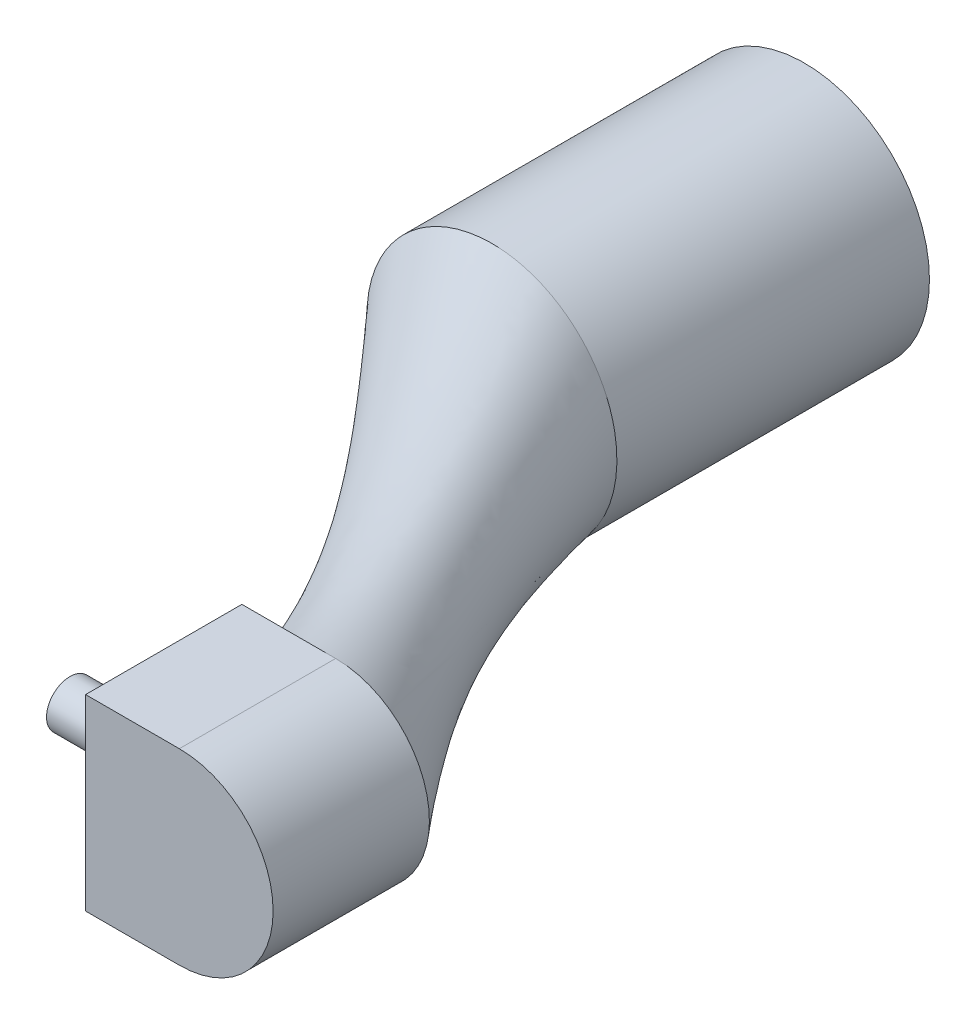
ISO-10303-21;
HEADER;
FILE_DESCRIPTION(('STEP AP214'),'2;1');
FILE_NAME('part.step','',(''),(''),'','','');
FILE_SCHEMA(('AUTOMOTIVE_DESIGN { 1 0 10303 214 1 1 1 1 }'));
ENDSEC;
DATA;
#1=APPLICATION_CONTEXT('core data for automotive mechanical design processes');
#2=APPLICATION_PROTOCOL_DEFINITION('international standard','automotive_design',2000,#1);
#3=PRODUCT_CONTEXT('',#1,'mechanical');
#4=PRODUCT('Part','Part','',(#3));
#5=PRODUCT_RELATED_PRODUCT_CATEGORY('part','',(#4));
#6=PRODUCT_DEFINITION_FORMATION('','',#4);
#7=PRODUCT_DEFINITION_CONTEXT('part definition',#1,'design');
#8=PRODUCT_DEFINITION('design','',#6,#7);
#9=PRODUCT_DEFINITION_SHAPE('','',#8);
#10=(LENGTH_UNIT() NAMED_UNIT(*) SI_UNIT(.MILLI.,.METRE.));
#11=(NAMED_UNIT(*) PLANE_ANGLE_UNIT() SI_UNIT($,.RADIAN.));
#12=(NAMED_UNIT(*) SI_UNIT($,.STERADIAN.) SOLID_ANGLE_UNIT());
#13=UNCERTAINTY_MEASURE_WITH_UNIT(LENGTH_MEASURE(1.E-05),#10,'distance_accuracy_value','');
#14=(GEOMETRIC_REPRESENTATION_CONTEXT(3) GLOBAL_UNCERTAINTY_ASSIGNED_CONTEXT((#13)) GLOBAL_UNIT_ASSIGNED_CONTEXT((#10,
#11,#12)) REPRESENTATION_CONTEXT('',''));
#15=CARTESIAN_POINT('',(0.,0.,0.));
#16=DIRECTION('',(0.,0.,1.));
#17=DIRECTION('',(1.,0.,0.));
#18=AXIS2_PLACEMENT_3D('',#15,#16,#17);
#19=CARTESIAN_POINT('',(8.,0.,28.));
#20=DIRECTION('',(0.,0.,-1.));
#21=DIRECTION('',(-1.,0.,0.));
#22=AXIS2_PLACEMENT_3D('',#19,#20,#21);
#23=CYLINDRICAL_SURFACE('',#22,3.);
#24=CARTESIAN_POINT('',(8.,0.,28.));
#25=DIRECTION('',(0.,0.,1.));
#26=DIRECTION('',(1.,0.,0.));
#27=AXIS2_PLACEMENT_3D('',#24,#25,#26);
#28=CIRCLE('',#27,3.);
#29=CARTESIAN_POINT('',(8.,-3.,28.));
#30=VERTEX_POINT('',#29);
#31=CARTESIAN_POINT('',(8.,3.,28.));
#32=VERTEX_POINT('',#31);
#33=EDGE_CURVE('E72',#30,#32,#28,.T.);
#34=ORIENTED_EDGE('',*,*,#33,.F.);
#35=DIRECTION('',(0.,0.,-1.));
#36=VECTOR('',#35,1.);
#37=CARTESIAN_POINT('',(8.,-3.,28.));
#38=LINE('',#37,#36);
#39=CARTESIAN_POINT('',(7.99691052595879,-2.99999681861154,23.));
#40=VERTEX_POINT('',#39);
#41=EDGE_CURVE('E231',#40,#30,#38,.F.);
#42=ORIENTED_EDGE('',*,*,#41,.F.);
#43=CARTESIAN_POINT('',(8.,0.,23.));
#44=DIRECTION('',(0.,0.,1.));
#45=DIRECTION('',(1.,0.,0.));
#46=AXIS2_PLACEMENT_3D('',#43,#44,#45);
#47=CIRCLE('',#46,3.);
#48=CARTESIAN_POINT('',(8.,3.,23.));
#49=VERTEX_POINT('',#48);
#50=EDGE_CURVE('E57',#40,#49,#47,.T.);
#51=ORIENTED_EDGE('',*,*,#50,.T.);
#52=DIRECTION('',(0.,0.,-1.));
#53=VECTOR('',#52,1.);
#54=CARTESIAN_POINT('',(8.,3.,28.));
#55=LINE('',#54,#53);
#56=EDGE_CURVE('E258',#49,#32,#55,.F.);
#57=ORIENTED_EDGE('',*,*,#56,.T.);
#58=EDGE_LOOP('',(#34,#42,#51,#57));
#59=FACE_BOUND('',#58,.T.);
#60=ADVANCED_FACE('F52',(#59),#23,.T.);
#61=CARTESIAN_POINT('',(0.,0.,10.));
#62=DIRECTION('',(0.,0.,-1.));
#63=DIRECTION('',(-1.,0.,0.));
#64=AXIS2_PLACEMENT_3D('',#61,#62,#63);
#65=CYLINDRICAL_SURFACE('',#64,4.);
#66=CARTESIAN_POINT('',(3.38536776104023,-2.13055981434679,10.));
#67=CARTESIAN_POINT('',(3.5629144122358,-1.8484458342601,10.));
#68=CARTESIAN_POINT('',(3.72945012408968,-1.50772882720066,10.));
#69=CARTESIAN_POINT('',(3.96356947314177,-0.687140070162643,10.));
#70=CARTESIAN_POINT('',(4.03019980479316,-0.204777874511993,10.));
#71=CARTESIAN_POINT('',(3.96484524376381,0.592548144976059,10.));
#72=CARTESIAN_POINT('',(3.91520814162501,0.869797637844003,10.));
#73=CARTESIAN_POINT('',(3.74721493560799,1.42960936951399,10.));
#74=CARTESIAN_POINT('',(3.62866488590891,1.71207909541891,10.));
#75=CARTESIAN_POINT('',(3.3173750321527,2.25686653997276,10.));
#76=CARTESIAN_POINT('',(3.12452087766088,2.51894578965913,10.));
#77=CARTESIAN_POINT('',(2.67212996789271,2.99456842314045,10.));
#78=CARTESIAN_POINT('',(2.41267379443348,3.20782110984467,10.));
#79=CARTESIAN_POINT('',(1.8484458342601,3.5629144122358,10.));
#80=CARTESIAN_POINT('',(1.54394113770462,3.70458693641862,10.));
#81=CARTESIAN_POINT('',(0.919424527747806,3.9067092474301,10.));
#82=CARTESIAN_POINT('',(0.59970956308234,3.96721213488091,10.));
#83=CARTESIAN_POINT('',(-0.0261266069788161,4.01219903339883,10.));
#84=CARTESIAN_POINT('',(-0.33208227767024,3.99688930093181,10.));
#85=CARTESIAN_POINT('',(-0.909475605640934,3.90618187566706,10.));
#86=CARTESIAN_POINT('',(-1.18091375301734,3.83099906278318,10.));
#87=CARTESIAN_POINT('',(-1.92804745463766,3.54500739873836,10.));
#88=CARTESIAN_POINT('',(-2.33411732712935,3.27626933380621,10.));
#89=CARTESIAN_POINT('',(-2.97267527803371,2.71021145592215,10.));
#90=CARTESIAN_POINT('',(-3.20782110984467,2.41267379443348,10.));
#91=CARTESIAN_POINT('',(-3.5629144122358,1.8484458342601,10.));
#92=CARTESIAN_POINT('',(-3.72945012408969,1.50772882720066,10.));
#93=CARTESIAN_POINT('',(-3.96356947314177,0.687140070162641,10.));
#94=CARTESIAN_POINT('',(-4.03019980479316,0.20477787451199,9.99999999999999));
#95=CARTESIAN_POINT('',(-3.96484524376381,-0.59254814497606,10.));
#96=CARTESIAN_POINT('',(-3.91520814162502,-0.869797637844004,10.));
#97=CARTESIAN_POINT('',(-3.74721493560799,-1.429609369514,10.));
#98=CARTESIAN_POINT('',(-3.62866488590891,-1.71207909541891,10.));
#99=CARTESIAN_POINT('',(-3.3173750321527,-2.25686653997276,10.));
#100=CARTESIAN_POINT('',(-3.12452087766088,-2.51894578965913,10.));
#101=CARTESIAN_POINT('',(-2.67212996789271,-2.99456842314045,10.));
#102=CARTESIAN_POINT('',(-2.41267379443348,-3.20782110984467,10.));
#103=CARTESIAN_POINT('',(-1.8484458342601,-3.5629144122358,10.));
#104=CARTESIAN_POINT('',(-1.54394113770462,-3.70458693641862,10.));
#105=CARTESIAN_POINT('',(-0.919424527747808,-3.9067092474301,10.));
#106=CARTESIAN_POINT('',(-0.599709563082343,-3.96721213488091,10.));
#107=CARTESIAN_POINT('',(0.0261266069788149,-4.01219903339883,10.));
#108=CARTESIAN_POINT('',(0.33208227767024,-3.99688930093181,10.));
#109=CARTESIAN_POINT('',(0.909475605640934,-3.90618187566707,10.));
#110=CARTESIAN_POINT('',(1.18091375301734,-3.83099906278318,10.));
#111=CARTESIAN_POINT('',(1.92804745463766,-3.54500739873836,10.));
#112=CARTESIAN_POINT('',(2.33411732712935,-3.27626933380622,10.));
#113=CARTESIAN_POINT('',(2.97267527803371,-2.71021145592216,10.));
#114=CARTESIAN_POINT('',(3.20782110984467,-2.41267379443348,10.));
#115=CARTESIAN_POINT('',(3.38536776104024,-2.13055981434679,10.));
#116=B_SPLINE_CURVE_WITH_KNOTS('',3,(#66,#67,#68,#69,#70,#71,#72,#73,#74,#75,#76,#77,#78,#79,
#80,#81,#82,#83,#84,#85,#86,#87,#88,#89,#90,#91,#92,#93,#94,#95,#96,#97,#98,#99,#100,#101,#102,
#103,#104,#105,#106,#107,#108,#109,#110,#111,#112,#113,#114,#115),.UNSPECIFIED.,.T.,.F.,(4,2,2,
2,2,2,2,2,2,2,2,2,2,2,2,2,2,2,2,2,2,2,2,2,4),(0.,0.0624999999999999,0.125,0.15625,0.1875,
0.21875,0.25,0.28125,0.3125,0.34375,0.375,0.4375,0.5,0.5625,0.624999999999999,0.65625,0.6875,
0.71875,0.75,0.78125,0.8125,0.84375,0.875,0.9375,1.),.UNSPECIFIED.);
#117=CARTESIAN_POINT('',(3.38536776104023,-2.13055981434679,10.));
#118=VERTEX_POINT('',#117);
#119=EDGE_CURVE('E64',#118,#118,#116,.T.);
#120=ORIENTED_EDGE('',*,*,#119,.F.);
#121=EDGE_LOOP('',(#120));
#122=FACE_BOUND('',#121,.T.);
#123=CARTESIAN_POINT('',(0.,0.,0.));
#124=DIRECTION('',(0.,0.,1.));
#125=DIRECTION('',(1.,0.,0.));
#126=AXIS2_PLACEMENT_3D('',#123,#124,#125);
#127=CIRCLE('',#126,4.);
#128=CARTESIAN_POINT('',(4.,0.,0.));
#129=VERTEX_POINT('',#128);
#130=EDGE_CURVE('E289',#129,#129,#127,.T.);
#131=ORIENTED_EDGE('',*,*,#130,.T.);
#132=EDGE_LOOP('',(#131));
#133=FACE_BOUND('',#132,.T.);
#134=ADVANCED_FACE('F54',(#122,#133),#65,.T.);
#135=CARTESIAN_POINT('',(0.,0.,0.));
#136=DIRECTION('',(0.,0.,1.));
#137=DIRECTION('',(1.,0.,0.));
#138=AXIS2_PLACEMENT_3D('',#135,#136,#137);
#139=PLANE('',#138);
#140=CARTESIAN_POINT('',(0.,0.,0.));
#141=DIRECTION('',(0.,0.,1.));
#142=DIRECTION('',(1.,0.,0.));
#143=AXIS2_PLACEMENT_3D('',#140,#141,#142);
#144=CIRCLE('',#143,2.);
#145=CARTESIAN_POINT('',(2.,0.,0.));
#146=VERTEX_POINT('',#145);
#147=EDGE_CURVE('E136',#146,#146,#144,.T.);
#148=ORIENTED_EDGE('',*,*,#147,.T.);
#149=EDGE_LOOP('',(#148));
#150=FACE_BOUND('',#149,.T.);
#151=ORIENTED_EDGE('',*,*,#130,.F.);
#152=EDGE_LOOP('',(#151));
#153=FACE_BOUND('',#152,.T.);
#154=ADVANCED_FACE('F278',(#150,#153),#139,.F.);
#155=CARTESIAN_POINT('',(0.,0.,5.));
#156=DIRECTION('',(0.,0.,-1.));
#157=DIRECTION('',(-1.,0.,0.));
#158=AXIS2_PLACEMENT_3D('',#155,#156,#157);
#159=CYLINDRICAL_SURFACE('',#158,2.);
#160=CARTESIAN_POINT('',(0.,0.,5.));
#161=DIRECTION('',(0.,0.,1.));
#162=DIRECTION('',(1.,0.,0.));
#163=AXIS2_PLACEMENT_3D('',#160,#161,#162);
#164=CIRCLE('',#163,2.);
#165=CARTESIAN_POINT('',(2.,0.,5.));
#166=VERTEX_POINT('',#165);
#167=EDGE_CURVE('E292',#166,#166,#164,.T.);
#168=ORIENTED_EDGE('',*,*,#167,.T.);
#169=EDGE_LOOP('',(#168));
#170=FACE_BOUND('',#169,.T.);
#171=ORIENTED_EDGE('',*,*,#147,.F.);
#172=EDGE_LOOP('',(#171));
#173=FACE_BOUND('',#172,.T.);
#174=ADVANCED_FACE('F283',(#170,#173),#159,.F.);
#175=CARTESIAN_POINT('',(0.,0.,5.));
#176=DIRECTION('',(0.,0.,1.));
#177=DIRECTION('',(1.,0.,0.));
#178=AXIS2_PLACEMENT_3D('',#175,#176,#177);
#179=PLANE('',#178);
#180=ORIENTED_EDGE('',*,*,#167,.F.);
#181=EDGE_LOOP('',(#180));
#182=FACE_BOUND('',#181,.T.);
#183=ADVANCED_FACE('F176',(#182),#179,.F.);
#184=CARTESIAN_POINT('',(3.38536776104023,-2.13055981434679,10.));
#185=CARTESIAN_POINT('',(9.74347265899898,2.44137319706001,23.));
#186=CARTESIAN_POINT('',(3.5629144122358,-1.8484458342601,10.));
#187=CARTESIAN_POINT('',(9.54002489257731,2.58666258530993,23.));
#188=CARTESIAN_POINT('',(3.72945012408968,-1.50772882720066,10.));
#189=CARTESIAN_POINT('',(9.29221758958993,2.72627469290136,23.));
#190=CARTESIAN_POINT('',(3.96356947314177,-0.687140070162643,10.));
#191=CARTESIAN_POINT('',(8.68808092533451,2.9375065344933,23.));
#192=CARTESIAN_POINT('',(4.03019980479316,-0.204777874511993,10.));
#193=CARTESIAN_POINT('',(8.32984516270283,3.00852159185231,23.));
#194=CARTESIAN_POINT('',(3.96484524376381,0.592548144976059,10.));
#195=CARTESIAN_POINT('',(7.73000873209335,2.99451243364494,23.));
#196=CARTESIAN_POINT('',(3.91520814162501,0.869797637844003,10.));
#197=CARTESIAN_POINT('',(7.52025239182277,2.96949175182581,23.));
#198=CARTESIAN_POINT('',(3.74721493560799,1.42960936951399,10.));
#199=CARTESIAN_POINT('',(7.09375204087998,2.86823180170363,23.));
#200=CARTESIAN_POINT('',(3.62866488590891,1.71207909541891,10.));
#201=CARTESIAN_POINT('',(6.87706880157616,2.791843270208,23.));
#202=CARTESIAN_POINT('',(3.3173750321527,2.25686653997276,10.));
#203=CARTESIAN_POINT('',(6.45554100031697,2.58263619584668,23.));
#204=CARTESIAN_POINT('',(3.12452087766088,2.51894578965913,10.));
#205=CARTESIAN_POINT('',(6.2508699762456,2.44972159152366,23.));
#206=CARTESIAN_POINT('',(2.67212996789271,2.99456842314045,10.));
#207=CARTESIAN_POINT('',(5.87494698157604,2.13183990601159,23.));
#208=CARTESIAN_POINT('',(2.41267379443348,3.20782110984467,10.));
#209=CARTESIAN_POINT('',(5.70391619118991,1.94692042542065,23.));
#210=CARTESIAN_POINT('',(1.8484458342601,3.5629144122358,10.));
#211=CARTESIAN_POINT('',(5.41333741469008,1.54002489257731,23.));
#212=CARTESIAN_POINT('',(1.54394113770462,3.70458693641862,10.));
#213=CARTESIAN_POINT('',(5.29392698065993,1.31824145359491,23.));
#214=CARTESIAN_POINT('',(0.919424527747806,3.9067092474301,10.));
#215=CARTESIAN_POINT('',(5.11523997445502,0.859506434527415,23.));
#216=CARTESIAN_POINT('',(0.59970956308234,3.96721213488091,10.));
#217=CARTESIAN_POINT('',(5.05593665122437,0.622779511701616,23.));
#218=CARTESIAN_POINT('',(-0.0261266069788161,4.01219903339883,10.));
#219=CARTESIAN_POINT('',(4.99484226314128,0.156173936357746,23.));
#220=CARTESIAN_POINT('',(-0.33208227767024,3.99688930093181,10.));
#221=CARTESIAN_POINT('',(4.9929040204286,-0.0735717429366443,23.));
#222=CARTESIAN_POINT('',(-0.909475605640934,3.90618187566706,10.));
#223=CARTESIAN_POINT('',(5.03552848723575,-0.50985064648628,23.));
#224=CARTESIAN_POINT('',(-1.18091375301734,3.83099906278318,10.));
#225=CARTESIAN_POINT('',(5.0799302904149,-0.716374825886275,23.));
#226=CARTESIAN_POINT('',(-1.92804745463766,3.54500739873836,10.));
#227=CARTESIAN_POINT('',(5.26133328286463,-1.28829523497331,23.));
#228=CARTESIAN_POINT('',(-2.33411732712935,3.27626933380621,10.));
#229=CARTESIAN_POINT('',(5.444756853554,-1.60409864489088,23.));
#230=CARTESIAN_POINT('',(-2.97267527803371,2.71021145592215,10.));
#231=CARTESIAN_POINT('',(5.84060665081436,-2.10699320442492,23.));
#232=CARTESIAN_POINT('',(-3.20782110984467,2.41267379443348,10.));
#233=CARTESIAN_POINT('',(6.05307957457936,-2.2960838088101,23.));
#234=CARTESIAN_POINT('',(-3.5629144122358,1.8484458342601,10.));
#235=CARTESIAN_POINT('',(6.45997510742269,-2.58666258530993,23.));
#236=CARTESIAN_POINT('',(-3.72945012408969,1.50772882720066,10.));
#237=CARTESIAN_POINT('',(6.70778241041008,-2.72627469290136,23.));
#238=CARTESIAN_POINT('',(-3.96356947314177,0.687140070162641,10.));
#239=CARTESIAN_POINT('',(7.3119190746655,-2.9375065344933,23.));
#240=CARTESIAN_POINT('',(-4.03019980479316,0.20477787451199,9.99999999999999));
#241=CARTESIAN_POINT('',(7.67015483729718,-3.00852159185231,23.));
#242=CARTESIAN_POINT('',(-3.96484524376381,-0.59254814497606,10.));
#243=CARTESIAN_POINT('',(8.26999126790666,-2.99451243364494,23.));
#244=CARTESIAN_POINT('',(-3.91520814162502,-0.869797637844004,10.));
#245=CARTESIAN_POINT('',(8.47974760817723,-2.9694917518258,23.));
#246=CARTESIAN_POINT('',(-3.74721493560799,-1.429609369514,10.));
#247=CARTESIAN_POINT('',(8.90624795912002,-2.86823180170363,23.));
#248=CARTESIAN_POINT('',(-3.62866488590891,-1.71207909541891,10.));
#249=CARTESIAN_POINT('',(9.12293119842384,-2.791843270208,23.));
#250=CARTESIAN_POINT('',(-3.3173750321527,-2.25686653997276,10.));
#251=CARTESIAN_POINT('',(9.54445899968303,-2.58263619584668,23.));
#252=CARTESIAN_POINT('',(-3.12452087766088,-2.51894578965913,10.));
#253=CARTESIAN_POINT('',(9.74913002375441,-2.44972159152366,23.));
#254=CARTESIAN_POINT('',(-2.67212996789271,-2.99456842314045,10.));
#255=CARTESIAN_POINT('',(10.125053018424,-2.13183990601159,23.));
#256=CARTESIAN_POINT('',(-2.41267379443348,-3.20782110984467,10.));
#257=CARTESIAN_POINT('',(10.2960838088101,-1.94692042542065,23.));
#258=CARTESIAN_POINT('',(-1.8484458342601,-3.5629144122358,10.));
#259=CARTESIAN_POINT('',(10.5866625853099,-1.54002489257731,23.));
#260=CARTESIAN_POINT('',(-1.54394113770462,-3.70458693641862,10.));
#261=CARTESIAN_POINT('',(10.7060730193401,-1.31824145359491,23.));
#262=CARTESIAN_POINT('',(-0.919424527747808,-3.9067092474301,10.));
#263=CARTESIAN_POINT('',(10.884760025545,-0.859506434527414,23.));
#264=CARTESIAN_POINT('',(-0.599709563082343,-3.96721213488091,10.));
#265=CARTESIAN_POINT('',(10.9440633487756,-0.622779511701616,23.));
#266=CARTESIAN_POINT('',(0.0261266069788149,-4.01219903339883,10.));
#267=CARTESIAN_POINT('',(11.0051577368587,-0.156173936357746,23.));
#268=CARTESIAN_POINT('',(0.33208227767024,-3.99688930093181,10.));
#269=CARTESIAN_POINT('',(11.0070959795714,0.0735717429366443,23.));
#270=CARTESIAN_POINT('',(0.909475605640934,-3.90618187566707,10.));
#271=CARTESIAN_POINT('',(10.9644715127643,0.509850646486282,23.));
#272=CARTESIAN_POINT('',(1.18091375301734,-3.83099906278318,10.));
#273=CARTESIAN_POINT('',(10.9200697095851,0.716374825886279,23.));
#274=CARTESIAN_POINT('',(1.92804745463766,-3.54500739873836,10.));
#275=CARTESIAN_POINT('',(10.7386667171354,1.28829523497332,23.));
#276=CARTESIAN_POINT('',(2.33411732712935,-3.27626933380622,10.));
#277=CARTESIAN_POINT('',(10.555243146446,1.60409864489088,23.));
#278=CARTESIAN_POINT('',(2.97267527803371,-2.71021145592216,10.));
#279=CARTESIAN_POINT('',(10.1593933491857,2.10699320442492,23.));
#280=CARTESIAN_POINT('',(3.20782110984467,-2.41267379443348,10.));
#281=CARTESIAN_POINT('',(9.94692042542064,2.2960838088101,23.));
#282=CARTESIAN_POINT('',(3.38536776104023,-2.13055981434679,10.));
#283=CARTESIAN_POINT('',(9.74347265899898,2.44137319706001,23.));
#284=B_SPLINE_SURFACE_WITH_KNOTS('',3,1,((#184,#185),(#186,#187),(#188,#189),(#190,#191),(#192,
#193),(#194,#195),(#196,#197),(#198,#199),(#200,#201),(#202,#203),(#204,#205),(#206,#207),(#208,
#209),(#210,#211),(#212,#213),(#214,#215),(#216,#217),(#218,#219),(#220,#221),(#222,#223),(#224,
#225),(#226,#227),(#228,#229),(#230,#231),(#232,#233),(#234,#235),(#236,#237),(#238,#239),(#240,
#241),(#242,#243),(#244,#245),(#246,#247),(#248,#249),(#250,#251),(#252,#253),(#254,#255),(#256,
#257),(#258,#259),(#260,#261),(#262,#263),(#264,#265),(#266,#267),(#268,#269),(#270,#271),(#272,
#273),(#274,#275),(#276,#277),(#278,#279),(#280,#281),(#282,#283)),.UNSPECIFIED.,.T.,.F.,.F.,(4,
2,2,2,2,2,2,2,2,2,2,2,2,2,2,2,2,2,2,2,2,2,2,2,4),(2,2),(0.,0.0624999999999999,0.125,0.15625,
0.1875,0.21875,0.25,0.28125,0.3125,0.34375,0.375,0.4375,0.5,0.5625,0.624999999999999,0.65625,
0.6875,0.71875,0.75,0.78125,0.8125,0.84375,0.875,0.9375,1.),(0.,1.),.UNSPECIFIED.);
#285=CARTESIAN_POINT('',(5.00002171744408,-2.56397066404969E-09,23.));
#286=VERTEX_POINT('',#285);
#287=EDGE_CURVE('E128',#49,#286,#47,.T.);
#288=CARTESIAN_POINT('',(9.74347265899898,2.44137319706001,23.));
#289=CARTESIAN_POINT('',(9.94692042542064,2.29608380881009,23.));
#290=CARTESIAN_POINT('',(10.1593933491856,2.10699320442492,23.));
#291=CARTESIAN_POINT('',(10.555243146446,1.60409864489087,23.));
#292=CARTESIAN_POINT('',(10.7386667171354,1.28829523497331,23.));
#293=CARTESIAN_POINT('',(10.9200697095851,0.716374825886276,23.));
#294=CARTESIAN_POINT('',(10.9644715127643,0.509850646486279,23.));
#295=CARTESIAN_POINT('',(11.0070959795714,0.0735717429366421,23.));
#296=CARTESIAN_POINT('',(11.0051577368587,-0.156173936357748,23.));
#297=CARTESIAN_POINT('',(10.9440633487756,-0.622779511701618,23.));
#298=CARTESIAN_POINT('',(10.884760025545,-0.859506434527416,23.));
#299=CARTESIAN_POINT('',(10.7060730193401,-1.31824145359491,23.));
#300=CARTESIAN_POINT('',(10.5866625853099,-1.54002489257731,23.));
#301=CARTESIAN_POINT('',(10.2960838088101,-1.94692042542065,23.));
#302=CARTESIAN_POINT('',(10.125053018424,-2.13183990601159,23.));
#303=CARTESIAN_POINT('',(9.74913002375441,-2.44972159152366,23.));
#304=CARTESIAN_POINT('',(9.54445899968303,-2.58263619584668,23.));
#305=CARTESIAN_POINT('',(9.12293119842384,-2.791843270208,23.));
#306=CARTESIAN_POINT('',(8.90624795912001,-2.86823180170363,23.));
#307=CARTESIAN_POINT('',(8.47974760817723,-2.9694917518258,23.));
#308=CARTESIAN_POINT('',(8.26999126790665,-2.99451243364494,23.));
#309=CARTESIAN_POINT('',(7.67015483729717,-3.00852159185231,23.));
#310=CARTESIAN_POINT('',(7.3119190746655,-2.93750653449329,23.));
#311=CARTESIAN_POINT('',(6.70778241041007,-2.72627469290136,23.));
#312=CARTESIAN_POINT('',(6.45997510742269,-2.58666258530992,23.));
#313=CARTESIAN_POINT('',(6.05307957457935,-2.2960838088101,23.));
#314=CARTESIAN_POINT('',(5.84060665081435,-2.10699320442492,23.));
#315=CARTESIAN_POINT('',(5.444756853554,-1.60409864489087,23.));
#316=CARTESIAN_POINT('',(5.26133328286462,-1.28829523497331,23.));
#317=CARTESIAN_POINT('',(5.0799302904149,-0.716374825886272,23.));
#318=CARTESIAN_POINT('',(5.03552848723574,-0.509850646486278,23.));
#319=CARTESIAN_POINT('',(4.99290402042859,-0.073571742936642,23.));
#320=CARTESIAN_POINT('',(4.99484226314128,0.156173936357748,23.));
#321=CARTESIAN_POINT('',(5.05593665122437,0.622779511701618,23.));
#322=CARTESIAN_POINT('',(5.11523997445501,0.859506434527417,23.));
#323=CARTESIAN_POINT('',(5.29392698065993,1.31824145359491,23.));
#324=CARTESIAN_POINT('',(5.41333741469008,1.54002489257731,23.));
#325=CARTESIAN_POINT('',(5.70391619118991,1.94692042542065,23.));
#326=CARTESIAN_POINT('',(5.87494698157603,2.13183990601159,23.));
#327=CARTESIAN_POINT('',(6.2508699762456,2.44972159152366,23.));
#328=CARTESIAN_POINT('',(6.45554100031697,2.58263619584668,23.));
#329=CARTESIAN_POINT('',(6.87706880157616,2.791843270208,23.));
#330=CARTESIAN_POINT('',(7.09375204087998,2.86823180170363,23.));
#331=CARTESIAN_POINT('',(7.52025239182277,2.9694917518258,23.));
#332=CARTESIAN_POINT('',(7.73000873209335,2.99451243364494,23.));
#333=CARTESIAN_POINT('',(8.32984516270282,3.0085215918523,23.));
#334=CARTESIAN_POINT('',(8.6880809253345,2.9375065344933,23.));
#335=CARTESIAN_POINT('',(9.29221758958993,2.72627469290135,23.));
#336=CARTESIAN_POINT('',(9.54002489257731,2.58666258530993,23.));
#337=CARTESIAN_POINT('',(9.74347265899898,2.44137319706001,23.));
#338=B_SPLINE_CURVE_WITH_KNOTS('',3,(#288,#289,#290,#291,#292,#293,#294,#295,#296,#297,#298,
#299,#300,#301,#302,#303,#304,#305,#306,#307,#308,#309,#310,#311,#312,#313,#314,#315,#316,#317,
#318,#319,#320,#321,#322,#323,#324,#325,#326,#327,#328,#329,#330,#331,#332,#333,#334,#335,#336,
#337),.UNSPECIFIED.,.T.,.F.,(4,2,2,2,2,2,2,2,2,2,2,2,2,2,2,2,2,2,2,2,2,2,2,2,4),(0.,
0.0625000000000001,0.125,0.15625,0.1875,0.21875,0.25,0.28125,0.3125,0.34375,0.375000000000001,
0.4375,0.5,0.5625,0.625,0.65625,0.6875,0.71875,0.75,0.78125,0.8125,0.84375,0.875,0.9375,1.),.UNSPECIFIED.);
#339=CARTESIAN_POINT('',(6.96177794539894,-2.8146264812034,23.));
#340=VERTEX_POINT('',#339);
#341=EDGE_CURVE('E149',#340,#40,#338,.F.);
#342=CARTESIAN_POINT('',(9.74347265899897,2.44137319706001,23.));
#343=CARTESIAN_POINT('',(9.94692042542064,2.29608380881009,23.));
#344=CARTESIAN_POINT('',(10.1593933491856,2.10699320442492,23.));
#345=CARTESIAN_POINT('',(10.555243146446,1.60409864489087,23.));
#346=CARTESIAN_POINT('',(10.7386667171354,1.28829523497331,23.));
#347=CARTESIAN_POINT('',(10.9200697095851,0.716374825886276,23.));
#348=CARTESIAN_POINT('',(10.9644715127643,0.509850646486279,23.));
#349=CARTESIAN_POINT('',(11.0070959795714,0.0735717429366416,23.));
#350=CARTESIAN_POINT('',(11.0051577368587,-0.156173936357748,23.));
#351=CARTESIAN_POINT('',(10.9440633487756,-0.622779511701618,23.));
#352=CARTESIAN_POINT('',(10.884760025545,-0.859506434527417,23.));
#353=CARTESIAN_POINT('',(10.7060730193401,-1.31824145359491,23.));
#354=CARTESIAN_POINT('',(10.5866625853099,-1.54002489257731,23.));
#355=CARTESIAN_POINT('',(10.2960838088101,-1.94692042542065,23.));
#356=CARTESIAN_POINT('',(10.125053018424,-2.13183990601159,23.));
#357=CARTESIAN_POINT('',(9.74913002375441,-2.44972159152366,23.));
#358=CARTESIAN_POINT('',(9.54445899968302,-2.58263619584668,23.));
#359=CARTESIAN_POINT('',(9.12293119842383,-2.791843270208,23.));
#360=CARTESIAN_POINT('',(8.90624795912001,-2.86823180170363,23.));
#361=CARTESIAN_POINT('',(8.47974760817722,-2.9694917518258,23.));
#362=CARTESIAN_POINT('',(8.26999126790665,-2.99451243364494,23.));
#363=CARTESIAN_POINT('',(7.67015483729717,-3.00852159185231,23.));
#364=CARTESIAN_POINT('',(7.31191907466549,-2.93750653449329,23.));
#365=CARTESIAN_POINT('',(6.70778241041007,-2.72627469290136,23.));
#366=CARTESIAN_POINT('',(6.45997510742268,-2.58666258530992,23.));
#367=CARTESIAN_POINT('',(6.05307957457935,-2.2960838088101,23.));
#368=CARTESIAN_POINT('',(5.84060665081435,-2.10699320442492,23.));
#369=CARTESIAN_POINT('',(5.444756853554,-1.60409864489087,23.));
#370=CARTESIAN_POINT('',(5.26133328286462,-1.28829523497331,23.));
#371=CARTESIAN_POINT('',(5.0799302904149,-0.716374825886272,23.));
#372=CARTESIAN_POINT('',(5.03552848723574,-0.509850646486277,23.));
#373=CARTESIAN_POINT('',(4.99290402042859,-0.0735717429366416,23.));
#374=CARTESIAN_POINT('',(4.99484226314128,0.156173936357749,23.));
#375=CARTESIAN_POINT('',(5.05593665122437,0.622779511701618,23.));
#376=CARTESIAN_POINT('',(5.11523997445501,0.859506434527417,23.));
#377=CARTESIAN_POINT('',(5.29392698065993,1.31824145359491,23.));
#378=CARTESIAN_POINT('',(5.41333741469007,1.54002489257731,23.));
#379=CARTESIAN_POINT('',(5.70391619118991,1.94692042542065,23.));
#380=CARTESIAN_POINT('',(5.87494698157603,2.13183990601159,23.));
#381=CARTESIAN_POINT('',(6.2508699762456,2.44972159152366,23.));
#382=CARTESIAN_POINT('',(6.45554100031697,2.58263619584668,23.));
#383=CARTESIAN_POINT('',(6.87706880157616,2.791843270208,23.));
#384=CARTESIAN_POINT('',(7.09375204087998,2.86823180170363,23.));
#385=CARTESIAN_POINT('',(7.52025239182277,2.9694917518258,23.));
#386=CARTESIAN_POINT('',(7.73000873209335,2.99451243364494,23.));
#387=CARTESIAN_POINT('',(8.32984516270283,3.0085215918523,23.));
#388=CARTESIAN_POINT('',(8.6880809253345,2.93750653449329,23.));
#389=CARTESIAN_POINT('',(9.29221758958993,2.72627469290135,23.));
#390=CARTESIAN_POINT('',(9.54002489257731,2.58666258530993,23.));
#391=CARTESIAN_POINT('',(9.74347265899897,2.44137319706001,23.));
#392=B_SPLINE_CURVE_WITH_KNOTS('',3,(#342,#343,#344,#345,#346,#347,#348,#349,#350,#351,#352,
#353,#354,#355,#356,#357,#358,#359,#360,#361,#362,#363,#364,#365,#366,#367,#368,#369,#370,#371,
#372,#373,#374,#375,#376,#377,#378,#379,#380,#381,#382,#383,#384,#385,#386,#387,#388,#389,#390,
#391),.UNSPECIFIED.,.T.,.F.,(4,2,2,2,2,2,2,2,2,2,2,2,2,2,2,2,2,2,2,2,2,2,2,2,4),(0.,
0.0625000000000001,0.125,0.15625,0.1875,0.21875,0.25,0.28125,0.3125,0.34375,0.375000000000001,
0.4375,0.5,0.5625,0.625,0.65625,0.6875,0.71875,0.75,0.78125,0.8125,0.84375,0.875,0.9375,1.),.UNSPECIFIED.);
#393=EDGE_CURVE('E101',#286,#340,#392,.F.);
#394=ORIENTED_EDGE('',*,*,#119,.T.);
#395=EDGE_LOOP('',(#394));
#396=FACE_BOUND('',#395,.T.);
#397=ORIENTED_EDGE('',*,*,#287,.F.);
#398=ORIENTED_EDGE('',*,*,#50,.F.);
#399=ORIENTED_EDGE('',*,*,#341,.F.);
#400=ORIENTED_EDGE('',*,*,#393,.F.);
#401=EDGE_LOOP('',(#397,#398,#399,#400));
#402=FACE_BOUND('',#401,.T.);
#403=ADVANCED_FACE('F148',(#396,#402),#284,.T.);
#404=CARTESIAN_POINT('',(8.,0.,28.));
#405=DIRECTION('',(0.,0.,1.));
#406=DIRECTION('',(1.,0.,0.));
#407=AXIS2_PLACEMENT_3D('',#404,#405,#406);
#408=PLANE('',#407);
#409=DIRECTION('',(0.,1.,0.));
#410=VECTOR('',#409,1.);
#411=CARTESIAN_POINT('',(5.,3.,28.));
#412=LINE('',#411,#410);
#413=CARTESIAN_POINT('',(5.,-3.,28.));
#414=VERTEX_POINT('',#413);
#415=CARTESIAN_POINT('',(5.,3.,28.));
#416=VERTEX_POINT('',#415);
#417=EDGE_CURVE('E144',#414,#416,#412,.T.);
#418=ORIENTED_EDGE('',*,*,#417,.F.);
#419=DIRECTION('',(-1.,0.,0.));
#420=VECTOR('',#419,1.);
#421=CARTESIAN_POINT('',(11.0679690382281,-3.,28.));
#422=LINE('',#421,#420);
#423=EDGE_CURVE('E145',#30,#414,#422,.T.);
#424=ORIENTED_EDGE('',*,*,#423,.F.);
#425=ORIENTED_EDGE('',*,*,#33,.T.);
#426=DIRECTION('',(-1.,0.,0.));
#427=VECTOR('',#426,1.);
#428=CARTESIAN_POINT('',(11.0679690382281,3.,28.));
#429=LINE('',#428,#427);
#430=EDGE_CURVE('E256',#32,#416,#429,.T.);
#431=ORIENTED_EDGE('',*,*,#430,.T.);
#432=EDGE_LOOP('',(#418,#424,#425,#431));
#433=FACE_BOUND('',#432,.T.);
#434=ADVANCED_FACE('F175',(#433),#408,.T.);
#435=CARTESIAN_POINT('',(2.,0.,25.5));
#436=DIRECTION('',(1.,0.,0.));
#437=DIRECTION('',(0.,0.,-1.));
#438=AXIS2_PLACEMENT_3D('',#435,#436,#437);
#439=CYLINDRICAL_SURFACE('',#438,0.750000000000002);
#440=CARTESIAN_POINT('',(2.,0.,25.5));
#441=DIRECTION('',(-1.,0.,0.));
#442=DIRECTION('',(0.,0.,1.));
#443=AXIS2_PLACEMENT_3D('',#440,#441,#442);
#444=CIRCLE('',#443,0.750000000000002);
#445=CARTESIAN_POINT('',(2.,0.,26.25));
#446=VERTEX_POINT('',#445);
#447=EDGE_CURVE('E259',#446,#446,#444,.T.);
#448=ORIENTED_EDGE('',*,*,#447,.F.);
#449=EDGE_LOOP('',(#448));
#450=FACE_BOUND('',#449,.T.);
#451=CARTESIAN_POINT('',(5.,0.,25.5));
#452=DIRECTION('',(-1.,0.,0.));
#453=DIRECTION('',(0.,0.,1.));
#454=AXIS2_PLACEMENT_3D('',#451,#452,#453);
#455=CIRCLE('',#454,0.750000000000002);
#456=CARTESIAN_POINT('',(5.,0.,26.25));
#457=VERTEX_POINT('',#456);
#458=EDGE_CURVE('E12',#457,#457,#455,.T.);
#459=ORIENTED_EDGE('',*,*,#458,.T.);
#460=EDGE_LOOP('',(#459));
#461=FACE_BOUND('',#460,.T.);
#462=ADVANCED_FACE('F328',(#450,#461),#439,.T.);
#463=CARTESIAN_POINT('',(2.,0.,25.5));
#464=DIRECTION('',(-1.,0.,0.));
#465=DIRECTION('',(0.,0.,1.));
#466=AXIS2_PLACEMENT_3D('',#463,#464,#465);
#467=PLANE('',#466);
#468=ORIENTED_EDGE('',*,*,#447,.T.);
#469=EDGE_LOOP('',(#468));
#470=FACE_BOUND('',#469,.T.);
#471=ADVANCED_FACE('F334',(#470),#467,.T.);
#472=CARTESIAN_POINT('',(5.,0.,0.));
#473=DIRECTION('',(-1.,0.,0.));
#474=DIRECTION('',(0.,0.,1.));
#475=AXIS2_PLACEMENT_3D('',#472,#473,#474);
#476=PLANE('',#475);
#477=ORIENTED_EDGE('',*,*,#458,.F.);
#478=EDGE_LOOP('',(#477));
#479=FACE_BOUND('',#478,.T.);
#480=DIRECTION('',(0.,-1.,0.));
#481=VECTOR('',#480,1.);
#482=CARTESIAN_POINT('',(5.,3.,23.));
#483=LINE('',#482,#481);
#484=CARTESIAN_POINT('',(5.,3.,23.));
#485=VERTEX_POINT('',#484);
#486=EDGE_CURVE('E131',#485,#286,#483,.T.);
#487=ORIENTED_EDGE('',*,*,#486,.T.);
#488=DIRECTION('',(0.,-1.,0.));
#489=VECTOR('',#488,1.);
#490=CARTESIAN_POINT('',(5.,3.,23.));
#491=LINE('',#490,#489);
#492=CARTESIAN_POINT('',(5.,-3.,23.));
#493=VERTEX_POINT('',#492);
#494=EDGE_CURVE('E116',#286,#493,#491,.T.);
#495=ORIENTED_EDGE('',*,*,#494,.T.);
#496=DIRECTION('',(0.,0.,1.));
#497=VECTOR('',#496,1.);
#498=CARTESIAN_POINT('',(5.,-3.,23.));
#499=LINE('',#498,#497);
#500=EDGE_CURVE('E124',#493,#414,#499,.T.);
#501=ORIENTED_EDGE('',*,*,#500,.T.);
#502=ORIENTED_EDGE('',*,*,#417,.T.);
#503=DIRECTION('',(0.,0.,-1.));
#504=VECTOR('',#503,1.);
#505=CARTESIAN_POINT('',(5.,3.,23.));
#506=LINE('',#505,#504);
#507=EDGE_CURVE('E142',#416,#485,#506,.T.);
#508=ORIENTED_EDGE('',*,*,#507,.T.);
#509=EDGE_LOOP('',(#487,#495,#501,#502,#508));
#510=FACE_BOUND('',#509,.T.);
#511=ADVANCED_FACE('F140',(#479,#510),#476,.T.);
#512=CARTESIAN_POINT('',(11.0679690382281,3.,23.));
#513=DIRECTION('',(0.,1.,0.));
#514=DIRECTION('',(0.,0.,1.));
#515=AXIS2_PLACEMENT_3D('',#512,#513,#514);
#516=PLANE('',#515);
#517=ORIENTED_EDGE('',*,*,#56,.F.);
#518=DIRECTION('',(-1.,0.,0.));
#519=VECTOR('',#518,1.);
#520=CARTESIAN_POINT('',(11.0679690382281,3.,23.));
#521=LINE('',#520,#519);
#522=EDGE_CURVE('E93',#49,#485,#521,.T.);
#523=ORIENTED_EDGE('',*,*,#522,.T.);
#524=ORIENTED_EDGE('',*,*,#507,.F.);
#525=ORIENTED_EDGE('',*,*,#430,.F.);
#526=EDGE_LOOP('',(#517,#523,#524,#525));
#527=FACE_BOUND('',#526,.T.);
#528=ADVANCED_FACE('F225',(#527),#516,.T.);
#529=CARTESIAN_POINT('',(11.0679690382281,3.,23.));
#530=DIRECTION('',(0.,0.,-1.));
#531=DIRECTION('',(-1.,0.,0.));
#532=AXIS2_PLACEMENT_3D('',#529,#530,#531);
#533=PLANE('',#532);
#534=ORIENTED_EDGE('',*,*,#522,.F.);
#535=ORIENTED_EDGE('',*,*,#287,.T.);
#536=ORIENTED_EDGE('',*,*,#486,.F.);
#537=EDGE_LOOP('',(#534,#535,#536));
#538=FACE_BOUND('',#537,.T.);
#539=ADVANCED_FACE('F130',(#538),#533,.T.);
#540=CARTESIAN_POINT('',(11.0679690382281,3.,23.));
#541=DIRECTION('',(0.,0.,-1.));
#542=DIRECTION('',(-1.,0.,0.));
#543=AXIS2_PLACEMENT_3D('',#540,#541,#542);
#544=PLANE('',#543);
#545=ORIENTED_EDGE('',*,*,#494,.F.);
#546=ORIENTED_EDGE('',*,*,#393,.T.);
#547=ORIENTED_EDGE('',*,*,#341,.T.);
#548=DIRECTION('',(-1.,0.,0.));
#549=VECTOR('',#548,1.);
#550=CARTESIAN_POINT('',(11.0679690382281,-3.,23.));
#551=LINE('',#550,#549);
#552=EDGE_CURVE('E114',#40,#493,#551,.T.);
#553=ORIENTED_EDGE('',*,*,#552,.T.);
#554=EDGE_LOOP('',(#545,#546,#547,#553));
#555=FACE_BOUND('',#554,.T.);
#556=ADVANCED_FACE('F118',(#555),#544,.T.);
#557=CARTESIAN_POINT('',(11.0679690382281,-3.,23.));
#558=DIRECTION('',(0.,-1.,0.));
#559=DIRECTION('',(0.,0.,-1.));
#560=AXIS2_PLACEMENT_3D('',#557,#558,#559);
#561=PLANE('',#560);
#562=ORIENTED_EDGE('',*,*,#552,.F.);
#563=ORIENTED_EDGE('',*,*,#41,.T.);
#564=ORIENTED_EDGE('',*,*,#423,.T.);
#565=ORIENTED_EDGE('',*,*,#500,.F.);
#566=EDGE_LOOP('',(#562,#563,#564,#565));
#567=FACE_BOUND('',#566,.T.);
#568=ADVANCED_FACE('F224',(#567),#561,.T.);
#569=CLOSED_SHELL('',(#60,#134,#154,#174,#183,#403,#434,#462,#471,#511,#528,#539,#556,#568));
#570=MANIFOLD_SOLID_BREP('B2',#569);
#571=ADVANCED_BREP_SHAPE_REPRESENTATION('',(#18,#570),#14);
#572=SHAPE_DEFINITION_REPRESENTATION(#9,#571);
ENDSEC;
END-ISO-10303-21;
